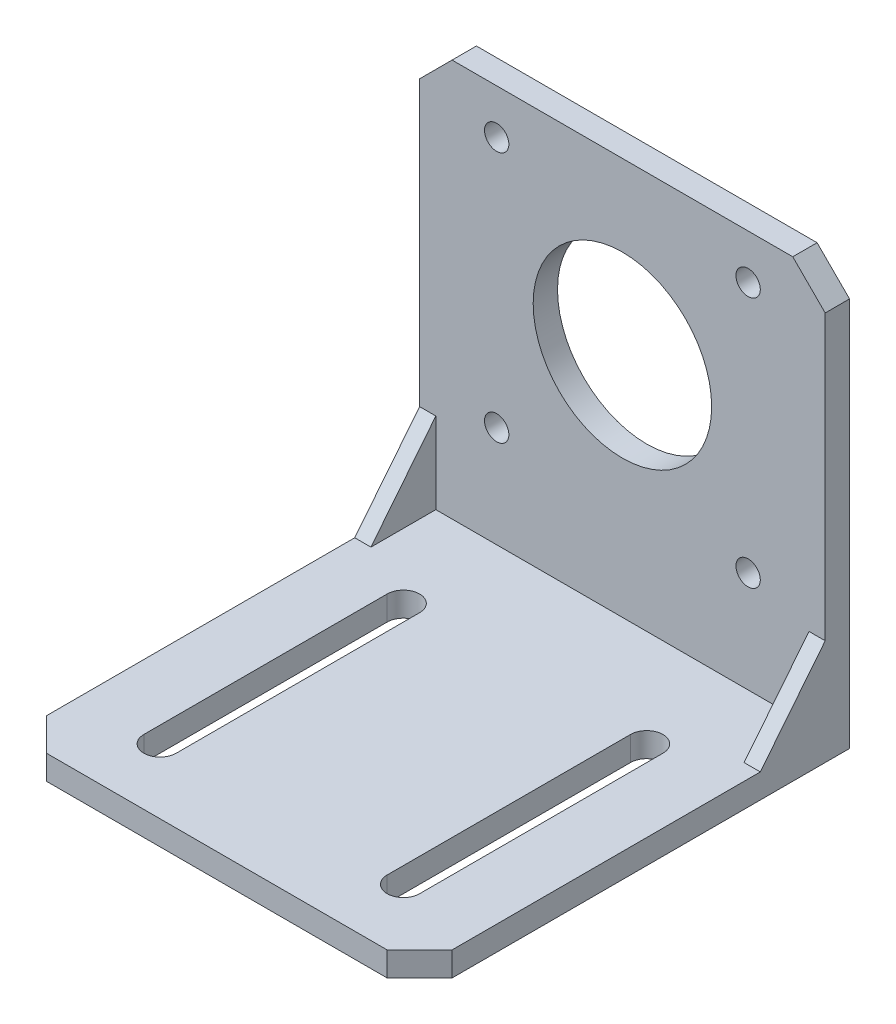
ISO-10303-21;
HEADER;
FILE_DESCRIPTION(('STEP AP214'),'2;1');
FILE_NAME('part.step','',(''),(''),'','','');
FILE_SCHEMA(('AUTOMOTIVE_DESIGN { 1 0 10303 214 1 1 1 1 }'));
ENDSEC;
DATA;
#1=APPLICATION_CONTEXT('core data for automotive mechanical design processes');
#2=APPLICATION_PROTOCOL_DEFINITION('international standard','automotive_design',2000,#1);
#3=PRODUCT_CONTEXT('',#1,'mechanical');
#4=PRODUCT('Part','Part','',(#3));
#5=PRODUCT_RELATED_PRODUCT_CATEGORY('part','',(#4));
#6=PRODUCT_DEFINITION_FORMATION('','',#4);
#7=PRODUCT_DEFINITION_CONTEXT('part definition',#1,'design');
#8=PRODUCT_DEFINITION('design','',#6,#7);
#9=PRODUCT_DEFINITION_SHAPE('','',#8);
#10=(LENGTH_UNIT() NAMED_UNIT(*) SI_UNIT(.MILLI.,.METRE.));
#11=(NAMED_UNIT(*) PLANE_ANGLE_UNIT() SI_UNIT($,.RADIAN.));
#12=(NAMED_UNIT(*) SI_UNIT($,.STERADIAN.) SOLID_ANGLE_UNIT());
#13=UNCERTAINTY_MEASURE_WITH_UNIT(LENGTH_MEASURE(1.E-05),#10,'distance_accuracy_value','');
#14=(GEOMETRIC_REPRESENTATION_CONTEXT(3) GLOBAL_UNCERTAINTY_ASSIGNED_CONTEXT((#13)) GLOBAL_UNIT_ASSIGNED_CONTEXT((#10,
#11,#12)) REPRESENTATION_CONTEXT('',''));
#15=CARTESIAN_POINT('',(0.,0.,0.));
#16=DIRECTION('',(0.,0.,1.));
#17=DIRECTION('',(1.,0.,0.));
#18=AXIS2_PLACEMENT_3D('',#15,#16,#17);
#19=CARTESIAN_POINT('',(0.,0.,3.));
#20=DIRECTION('',(0.,0.,1.));
#21=DIRECTION('',(1.,0.,0.));
#22=AXIS2_PLACEMENT_3D('',#19,#20,#21);
#23=PLANE('',#22);
#24=DIRECTION('',(-1.,0.,0.));
#25=VECTOR('',#24,1.);
#26=CARTESIAN_POINT('',(-23.,-13.,3.));
#27=LINE('',#26,#25);
#28=CARTESIAN_POINT('',(-23.,-13.,3.));
#29=VERTEX_POINT('',#28);
#30=CARTESIAN_POINT('',(-25.,-13.,3.));
#31=VERTEX_POINT('',#30);
#32=EDGE_CURVE('E268',#29,#31,#27,.T.);
#33=ORIENTED_EDGE('',*,*,#32,.F.);
#34=DIRECTION('',(0.,-1.,0.));
#35=VECTOR('',#34,1.);
#36=CARTESIAN_POINT('',(-23.,-13.,3.));
#37=LINE('',#36,#35);
#38=CARTESIAN_POINT('',(-23.,-23.,3.));
#39=VERTEX_POINT('',#38);
#40=EDGE_CURVE('E262',#29,#39,#37,.T.);
#41=ORIENTED_EDGE('',*,*,#40,.T.);
#42=DIRECTION('',(-1.,0.,0.));
#43=VECTOR('',#42,1.);
#44=CARTESIAN_POINT('',(-25.,-23.,3.));
#45=LINE('',#44,#43);
#46=CARTESIAN_POINT('',(23.,-23.,3.));
#47=VERTEX_POINT('',#46);
#48=EDGE_CURVE('E293',#47,#39,#45,.T.);
#49=ORIENTED_EDGE('',*,*,#48,.F.);
#50=DIRECTION('',(0.,-1.,0.));
#51=VECTOR('',#50,1.);
#52=CARTESIAN_POINT('',(23.,0.,3.));
#53=LINE('',#52,#51);
#54=CARTESIAN_POINT('',(23.,-13.,3.));
#55=VERTEX_POINT('',#54);
#56=EDGE_CURVE('E276',#55,#47,#53,.T.);
#57=ORIENTED_EDGE('',*,*,#56,.F.);
#58=DIRECTION('',(1.,0.,0.));
#59=VECTOR('',#58,1.);
#60=CARTESIAN_POINT('',(23.,-13.,3.));
#61=LINE('',#60,#59);
#62=CARTESIAN_POINT('',(25.,-13.,3.));
#63=VERTEX_POINT('',#62);
#64=EDGE_CURVE('E285',#55,#63,#61,.T.);
#65=ORIENTED_EDGE('',*,*,#64,.T.);
#66=DIRECTION('',(0.,1.,0.));
#67=VECTOR('',#66,1.);
#68=CARTESIAN_POINT('',(25.,26.,3.));
#69=LINE('',#68,#67);
#70=CARTESIAN_POINT('',(25.,22.,3.));
#71=VERTEX_POINT('',#70);
#72=EDGE_CURVE('E336',#63,#71,#69,.T.);
#73=ORIENTED_EDGE('',*,*,#72,.T.);
#74=DIRECTION('',(0.707106781186546,-0.707106781186549,0.));
#75=VECTOR('',#74,1.);
#76=CARTESIAN_POINT('',(23.5000000000001,23.4999999999999,3.));
#77=LINE('',#76,#75);
#78=CARTESIAN_POINT('',(21.,26.,3.));
#79=VERTEX_POINT('',#78);
#80=EDGE_CURVE('E371',#71,#79,#77,.F.);
#81=ORIENTED_EDGE('',*,*,#80,.T.);
#82=DIRECTION('',(-1.,0.,0.));
#83=VECTOR('',#82,1.);
#84=CARTESIAN_POINT('',(-25.,26.,3.));
#85=LINE('',#84,#83);
#86=CARTESIAN_POINT('',(-21.,26.,3.));
#87=VERTEX_POINT('',#86);
#88=EDGE_CURVE('E338',#79,#87,#85,.T.);
#89=ORIENTED_EDGE('',*,*,#88,.T.);
#90=DIRECTION('',(0.707106781186549,0.707106781186546,0.));
#91=VECTOR('',#90,1.);
#92=CARTESIAN_POINT('',(-23.5,23.5,3.));
#93=LINE('',#92,#91);
#94=CARTESIAN_POINT('',(-25.,22.,3.));
#95=VERTEX_POINT('',#94);
#96=EDGE_CURVE('E373',#87,#95,#93,.F.);
#97=ORIENTED_EDGE('',*,*,#96,.T.);
#98=DIRECTION('',(0.,-1.,0.));
#99=VECTOR('',#98,1.);
#100=CARTESIAN_POINT('',(-25.,26.,3.));
#101=LINE('',#100,#99);
#102=EDGE_CURVE('E342',#95,#31,#101,.T.);
#103=ORIENTED_EDGE('',*,*,#102,.T.);
#104=EDGE_LOOP('',(#33,#41,#49,#57,#65,#73,#81,#89,#97,#103));
#105=FACE_BOUND('',#104,.T.);
#106=CARTESIAN_POINT('',(15.5,-10.5,3.));
#107=DIRECTION('',(0.,0.,1.));
#108=DIRECTION('',(1.,0.,0.));
#109=AXIS2_PLACEMENT_3D('',#106,#107,#108);
#110=CIRCLE('',#109,1.5);
#111=CARTESIAN_POINT('',(17.,-10.5,3.));
#112=VERTEX_POINT('',#111);
#113=EDGE_CURVE('E312',#112,#112,#110,.T.);
#114=ORIENTED_EDGE('',*,*,#113,.F.);
#115=EDGE_LOOP('',(#114));
#116=FACE_BOUND('',#115,.T.);
#117=CARTESIAN_POINT('',(15.5,20.5,3.));
#118=DIRECTION('',(0.,0.,1.));
#119=DIRECTION('',(1.,0.,0.));
#120=AXIS2_PLACEMENT_3D('',#117,#118,#119);
#121=CIRCLE('',#120,1.5);
#122=CARTESIAN_POINT('',(17.,20.5,3.));
#123=VERTEX_POINT('',#122);
#124=EDGE_CURVE('E324',#123,#123,#121,.T.);
#125=ORIENTED_EDGE('',*,*,#124,.F.);
#126=EDGE_LOOP('',(#125));
#127=FACE_BOUND('',#126,.T.);
#128=CARTESIAN_POINT('',(0.,5.,3.));
#129=DIRECTION('',(0.,0.,1.));
#130=DIRECTION('',(1.,0.,0.));
#131=AXIS2_PLACEMENT_3D('',#128,#129,#130);
#132=CIRCLE('',#131,11.);
#133=CARTESIAN_POINT('',(11.,5.,3.));
#134=VERTEX_POINT('',#133);
#135=EDGE_CURVE('E330',#134,#134,#132,.T.);
#136=ORIENTED_EDGE('',*,*,#135,.F.);
#137=EDGE_LOOP('',(#136));
#138=FACE_BOUND('',#137,.T.);
#139=CARTESIAN_POINT('',(-15.5,20.5,3.));
#140=DIRECTION('',(0.,0.,1.));
#141=DIRECTION('',(1.,0.,0.));
#142=AXIS2_PLACEMENT_3D('',#139,#140,#141);
#143=CIRCLE('',#142,1.5);
#144=CARTESIAN_POINT('',(-14.,20.5,3.));
#145=VERTEX_POINT('',#144);
#146=EDGE_CURVE('E318',#145,#145,#143,.T.);
#147=ORIENTED_EDGE('',*,*,#146,.F.);
#148=EDGE_LOOP('',(#147));
#149=FACE_BOUND('',#148,.T.);
#150=CARTESIAN_POINT('',(-15.5,-10.5,3.));
#151=DIRECTION('',(0.,0.,1.));
#152=DIRECTION('',(1.,0.,0.));
#153=AXIS2_PLACEMENT_3D('',#150,#151,#152);
#154=CIRCLE('',#153,1.5);
#155=CARTESIAN_POINT('',(-14.,-10.5,3.));
#156=VERTEX_POINT('',#155);
#157=EDGE_CURVE('E306',#156,#156,#154,.T.);
#158=ORIENTED_EDGE('',*,*,#157,.F.);
#159=EDGE_LOOP('',(#158));
#160=FACE_BOUND('',#159,.T.);
#161=ADVANCED_FACE('F39',(#105,#116,#127,#138,#149,#160),#23,.T.);
#162=CARTESIAN_POINT('',(0.,0.,0.));
#163=DIRECTION('',(0.,0.,1.));
#164=DIRECTION('',(1.,0.,0.));
#165=AXIS2_PLACEMENT_3D('',#162,#163,#164);
#166=PLANE('',#165);
#167=DIRECTION('',(0.,-1.,0.));
#168=VECTOR('',#167,1.);
#169=CARTESIAN_POINT('',(-25.,26.,0.));
#170=LINE('',#169,#168);
#171=CARTESIAN_POINT('',(-25.,22.,0.));
#172=VERTEX_POINT('',#171);
#173=CARTESIAN_POINT('',(-25.,-26.,0.));
#174=VERTEX_POINT('',#173);
#175=EDGE_CURVE('E351',#172,#174,#170,.T.);
#176=ORIENTED_EDGE('',*,*,#175,.F.);
#177=DIRECTION('',(-0.707106781186549,-0.707106781186546,0.));
#178=VECTOR('',#177,1.);
#179=CARTESIAN_POINT('',(-25.,22.,0.));
#180=LINE('',#179,#178);
#181=CARTESIAN_POINT('',(-21.,26.,0.));
#182=VERTEX_POINT('',#181);
#183=EDGE_CURVE('E364',#172,#182,#180,.F.);
#184=ORIENTED_EDGE('',*,*,#183,.T.);
#185=DIRECTION('',(-1.,0.,0.));
#186=VECTOR('',#185,1.);
#187=CARTESIAN_POINT('',(-25.,26.,0.));
#188=LINE('',#187,#186);
#189=CARTESIAN_POINT('',(21.,26.,0.));
#190=VERTEX_POINT('',#189);
#191=EDGE_CURVE('E348',#190,#182,#188,.T.);
#192=ORIENTED_EDGE('',*,*,#191,.F.);
#193=DIRECTION('',(-0.707106781186546,0.707106781186549,0.));
#194=VECTOR('',#193,1.);
#195=CARTESIAN_POINT('',(21.,26.,0.));
#196=LINE('',#195,#194);
#197=CARTESIAN_POINT('',(25.,22.,0.));
#198=VERTEX_POINT('',#197);
#199=EDGE_CURVE('E362',#190,#198,#196,.F.);
#200=ORIENTED_EDGE('',*,*,#199,.T.);
#201=DIRECTION('',(0.,1.,0.));
#202=VECTOR('',#201,1.);
#203=CARTESIAN_POINT('',(25.,26.,0.));
#204=LINE('',#203,#202);
#205=CARTESIAN_POINT('',(25.,-26.,0.));
#206=VERTEX_POINT('',#205);
#207=EDGE_CURVE('E333',#206,#198,#204,.T.);
#208=ORIENTED_EDGE('',*,*,#207,.F.);
#209=DIRECTION('',(1.,0.,0.));
#210=VECTOR('',#209,1.);
#211=CARTESIAN_POINT('',(-25.,-26.,0.));
#212=LINE('',#211,#210);
#213=EDGE_CURVE('E339',#174,#206,#212,.T.);
#214=ORIENTED_EDGE('',*,*,#213,.F.);
#215=EDGE_LOOP('',(#176,#184,#192,#200,#208,#214));
#216=FACE_BOUND('',#215,.T.);
#217=CARTESIAN_POINT('',(0.,5.,0.));
#218=DIRECTION('',(0.,0.,1.));
#219=DIRECTION('',(1.,0.,0.));
#220=AXIS2_PLACEMENT_3D('',#217,#218,#219);
#221=CIRCLE('',#220,11.);
#222=CARTESIAN_POINT('',(11.,5.,0.));
#223=VERTEX_POINT('',#222);
#224=EDGE_CURVE('E327',#223,#223,#221,.T.);
#225=ORIENTED_EDGE('',*,*,#224,.T.);
#226=EDGE_LOOP('',(#225));
#227=FACE_BOUND('',#226,.T.);
#228=CARTESIAN_POINT('',(15.5,20.5,0.));
#229=DIRECTION('',(0.,0.,1.));
#230=DIRECTION('',(1.,0.,0.));
#231=AXIS2_PLACEMENT_3D('',#228,#229,#230);
#232=CIRCLE('',#231,1.5);
#233=CARTESIAN_POINT('',(17.,20.5,0.));
#234=VERTEX_POINT('',#233);
#235=EDGE_CURVE('E321',#234,#234,#232,.T.);
#236=ORIENTED_EDGE('',*,*,#235,.T.);
#237=EDGE_LOOP('',(#236));
#238=FACE_BOUND('',#237,.T.);
#239=CARTESIAN_POINT('',(-15.5,20.5,0.));
#240=DIRECTION('',(0.,0.,1.));
#241=DIRECTION('',(1.,0.,0.));
#242=AXIS2_PLACEMENT_3D('',#239,#240,#241);
#243=CIRCLE('',#242,1.5);
#244=CARTESIAN_POINT('',(-14.,20.5,0.));
#245=VERTEX_POINT('',#244);
#246=EDGE_CURVE('E315',#245,#245,#243,.T.);
#247=ORIENTED_EDGE('',*,*,#246,.T.);
#248=EDGE_LOOP('',(#247));
#249=FACE_BOUND('',#248,.T.);
#250=CARTESIAN_POINT('',(15.5,-10.5,0.));
#251=DIRECTION('',(0.,0.,1.));
#252=DIRECTION('',(1.,0.,0.));
#253=AXIS2_PLACEMENT_3D('',#250,#251,#252);
#254=CIRCLE('',#253,1.5);
#255=CARTESIAN_POINT('',(17.,-10.5,0.));
#256=VERTEX_POINT('',#255);
#257=EDGE_CURVE('E309',#256,#256,#254,.T.);
#258=ORIENTED_EDGE('',*,*,#257,.T.);
#259=EDGE_LOOP('',(#258));
#260=FACE_BOUND('',#259,.T.);
#261=CARTESIAN_POINT('',(-15.5,-10.5,0.));
#262=DIRECTION('',(0.,0.,1.));
#263=DIRECTION('',(1.,0.,0.));
#264=AXIS2_PLACEMENT_3D('',#261,#262,#263);
#265=CIRCLE('',#264,1.5);
#266=CARTESIAN_POINT('',(-14.,-10.5,0.));
#267=VERTEX_POINT('',#266);
#268=EDGE_CURVE('E301',#267,#267,#265,.T.);
#269=ORIENTED_EDGE('',*,*,#268,.T.);
#270=EDGE_LOOP('',(#269));
#271=FACE_BOUND('',#270,.T.);
#272=ADVANCED_FACE('F439',(#216,#227,#238,#249,#260,#271),#166,.F.);
#273=CARTESIAN_POINT('',(25.,26.,3.));
#274=DIRECTION('',(-1.,0.,0.));
#275=DIRECTION('',(0.,-1.,0.));
#276=AXIS2_PLACEMENT_3D('',#273,#274,#275);
#277=PLANE('',#276);
#278=DIRECTION('',(0.,0.,-1.));
#279=VECTOR('',#278,1.);
#280=CARTESIAN_POINT('',(25.,-23.,156.089919145473));
#281=LINE('',#280,#279);
#282=CARTESIAN_POINT('',(25.,-23.,49.));
#283=VERTEX_POINT('',#282);
#284=CARTESIAN_POINT('',(25.,-23.,11.));
#285=VERTEX_POINT('',#284);
#286=EDGE_CURVE('E297',#283,#285,#281,.T.);
#287=ORIENTED_EDGE('',*,*,#286,.F.);
#288=DIRECTION('',(0.,-1.,0.));
#289=VECTOR('',#288,1.);
#290=CARTESIAN_POINT('',(25.,-26.,49.));
#291=LINE('',#290,#289);
#292=CARTESIAN_POINT('',(25.,-26.,49.));
#293=VERTEX_POINT('',#292);
#294=EDGE_CURVE('E388',#283,#293,#291,.T.);
#295=ORIENTED_EDGE('',*,*,#294,.T.);
#296=DIRECTION('',(0.,0.,-1.));
#297=VECTOR('',#296,1.);
#298=CARTESIAN_POINT('',(25.,-26.,3.));
#299=LINE('',#298,#297);
#300=EDGE_CURVE('E345',#293,#206,#299,.T.);
#301=ORIENTED_EDGE('',*,*,#300,.T.);
#302=ORIENTED_EDGE('',*,*,#207,.T.);
#303=DIRECTION('',(0.,0.,1.));
#304=VECTOR('',#303,1.);
#305=CARTESIAN_POINT('',(25.,22.,3.));
#306=LINE('',#305,#304);
#307=EDGE_CURVE('E375',#198,#71,#306,.T.);
#308=ORIENTED_EDGE('',*,*,#307,.T.);
#309=ORIENTED_EDGE('',*,*,#72,.F.);
#310=DIRECTION('',(0.,-0.78086880944303,0.624695047554425));
#311=VECTOR('',#310,1.);
#312=CARTESIAN_POINT('',(25.,-3.60975609756097,-4.51219512195122));
#313=LINE('',#312,#311);
#314=EDGE_CURVE('E274',#63,#285,#313,.T.);
#315=ORIENTED_EDGE('',*,*,#314,.T.);
#316=EDGE_LOOP('',(#287,#295,#301,#302,#308,#309,#315));
#317=FACE_BOUND('',#316,.T.);
#318=ADVANCED_FACE('F407',(#317),#277,.F.);
#319=CARTESIAN_POINT('',(-25.,26.,3.));
#320=DIRECTION('',(0.,-1.,0.));
#321=DIRECTION('',(0.,0.,-1.));
#322=AXIS2_PLACEMENT_3D('',#319,#320,#321);
#323=PLANE('',#322);
#324=ORIENTED_EDGE('',*,*,#191,.T.);
#325=DIRECTION('',(0.,0.,1.));
#326=VECTOR('',#325,1.);
#327=CARTESIAN_POINT('',(-21.,26.,3.));
#328=LINE('',#327,#326);
#329=EDGE_CURVE('E369',#182,#87,#328,.T.);
#330=ORIENTED_EDGE('',*,*,#329,.T.);
#331=ORIENTED_EDGE('',*,*,#88,.F.);
#332=DIRECTION('',(0.,0.,-1.));
#333=VECTOR('',#332,1.);
#334=CARTESIAN_POINT('',(21.,26.,3.));
#335=LINE('',#334,#333);
#336=EDGE_CURVE('E366',#79,#190,#335,.T.);
#337=ORIENTED_EDGE('',*,*,#336,.T.);
#338=EDGE_LOOP('',(#324,#330,#331,#337));
#339=FACE_BOUND('',#338,.T.);
#340=ADVANCED_FACE('F443',(#339),#323,.F.);
#341=CARTESIAN_POINT('',(-25.,26.,3.));
#342=DIRECTION('',(1.,0.,0.));
#343=DIRECTION('',(0.,1.,0.));
#344=AXIS2_PLACEMENT_3D('',#341,#342,#343);
#345=PLANE('',#344);
#346=DIRECTION('',(0.,0.,-1.));
#347=VECTOR('',#346,1.);
#348=CARTESIAN_POINT('',(-25.,-26.,3.));
#349=LINE('',#348,#347);
#350=CARTESIAN_POINT('',(-25.,-26.,49.));
#351=VERTEX_POINT('',#350);
#352=EDGE_CURVE('E357',#351,#174,#349,.T.);
#353=ORIENTED_EDGE('',*,*,#352,.F.);
#354=DIRECTION('',(0.,1.,0.));
#355=VECTOR('',#354,1.);
#356=CARTESIAN_POINT('',(-25.,-23.,49.));
#357=LINE('',#356,#355);
#358=CARTESIAN_POINT('',(-25.,-23.,49.));
#359=VERTEX_POINT('',#358);
#360=EDGE_CURVE('E12',#351,#359,#357,.T.);
#361=ORIENTED_EDGE('',*,*,#360,.T.);
#362=DIRECTION('',(0.,0.,-1.));
#363=VECTOR('',#362,1.);
#364=CARTESIAN_POINT('',(-25.,-23.,156.089919145473));
#365=LINE('',#364,#363);
#366=CARTESIAN_POINT('',(-25.,-23.,11.));
#367=VERTEX_POINT('',#366);
#368=EDGE_CURVE('E291',#359,#367,#365,.T.);
#369=ORIENTED_EDGE('',*,*,#368,.T.);
#370=DIRECTION('',(0.,0.78086880944303,-0.624695047554424));
#371=VECTOR('',#370,1.);
#372=CARTESIAN_POINT('',(-25.,-23.,11.));
#373=LINE('',#372,#371);
#374=EDGE_CURVE('E226',#367,#31,#373,.T.);
#375=ORIENTED_EDGE('',*,*,#374,.T.);
#376=ORIENTED_EDGE('',*,*,#102,.F.);
#377=DIRECTION('',(0.,0.,-1.));
#378=VECTOR('',#377,1.);
#379=CARTESIAN_POINT('',(-25.,22.,3.));
#380=LINE('',#379,#378);
#381=EDGE_CURVE('E359',#95,#172,#380,.T.);
#382=ORIENTED_EDGE('',*,*,#381,.T.);
#383=ORIENTED_EDGE('',*,*,#175,.T.);
#384=EDGE_LOOP('',(#353,#361,#369,#375,#376,#382,#383));
#385=FACE_BOUND('',#384,.T.);
#386=ADVANCED_FACE('F432',(#385),#345,.F.);
#387=CARTESIAN_POINT('',(-25.,-26.,3.));
#388=DIRECTION('',(0.,1.,0.));
#389=DIRECTION('',(0.,0.,1.));
#390=AXIS2_PLACEMENT_3D('',#387,#388,#389);
#391=PLANE('',#390);
#392=DIRECTION('',(0.,0.,-1.));
#393=VECTOR('',#392,1.);
#394=CARTESIAN_POINT('',(-13.,-26.,15.));
#395=LINE('',#394,#393);
#396=CARTESIAN_POINT('',(-13.,-26.,45.));
#397=VERTEX_POINT('',#396);
#398=CARTESIAN_POINT('',(-13.,-26.,15.));
#399=VERTEX_POINT('',#398);
#400=EDGE_CURVE('E200',#397,#399,#395,.T.);
#401=ORIENTED_EDGE('',*,*,#400,.T.);
#402=CARTESIAN_POINT('',(-15.,-26.,15.));
#403=DIRECTION('',(0.,1.,0.));
#404=DIRECTION('',(0.,0.,1.));
#405=AXIS2_PLACEMENT_3D('',#402,#403,#404);
#406=CIRCLE('',#405,2.);
#407=CARTESIAN_POINT('',(-17.,-26.,15.));
#408=VERTEX_POINT('',#407);
#409=EDGE_CURVE('E192',#399,#408,#406,.T.);
#410=ORIENTED_EDGE('',*,*,#409,.T.);
#411=DIRECTION('',(0.,0.,1.));
#412=VECTOR('',#411,1.);
#413=CARTESIAN_POINT('',(-17.,-26.,15.));
#414=LINE('',#413,#412);
#415=CARTESIAN_POINT('',(-17.,-26.,45.));
#416=VERTEX_POINT('',#415);
#417=EDGE_CURVE('E203',#408,#416,#414,.T.);
#418=ORIENTED_EDGE('',*,*,#417,.T.);
#419=CARTESIAN_POINT('',(-15.,-26.,45.));
#420=DIRECTION('',(0.,1.,0.));
#421=DIRECTION('',(0.,0.,1.));
#422=AXIS2_PLACEMENT_3D('',#419,#420,#421);
#423=CIRCLE('',#422,2.);
#424=EDGE_CURVE('E55',#416,#397,#423,.T.);
#425=ORIENTED_EDGE('',*,*,#424,.T.);
#426=EDGE_LOOP('',(#401,#410,#418,#425));
#427=FACE_BOUND('',#426,.T.);
#428=DIRECTION('',(0.,0.,-1.));
#429=VECTOR('',#428,1.);
#430=CARTESIAN_POINT('',(17.,-26.,15.));
#431=LINE('',#430,#429);
#432=CARTESIAN_POINT('',(17.,-26.,45.));
#433=VERTEX_POINT('',#432);
#434=CARTESIAN_POINT('',(17.,-26.,15.));
#435=VERTEX_POINT('',#434);
#436=EDGE_CURVE('E238',#433,#435,#431,.T.);
#437=ORIENTED_EDGE('',*,*,#436,.T.);
#438=CARTESIAN_POINT('',(15.,-26.,15.));
#439=DIRECTION('',(0.,1.,0.));
#440=DIRECTION('',(0.,0.,-1.));
#441=AXIS2_PLACEMENT_3D('',#438,#439,#440);
#442=CIRCLE('',#441,2.);
#443=CARTESIAN_POINT('',(13.,-26.,15.));
#444=VERTEX_POINT('',#443);
#445=EDGE_CURVE('E230',#435,#444,#442,.T.);
#446=ORIENTED_EDGE('',*,*,#445,.T.);
#447=DIRECTION('',(0.,0.,1.));
#448=VECTOR('',#447,1.);
#449=CARTESIAN_POINT('',(13.,-26.,15.));
#450=LINE('',#449,#448);
#451=CARTESIAN_POINT('',(13.,-26.,45.));
#452=VERTEX_POINT('',#451);
#453=EDGE_CURVE('E233',#444,#452,#450,.T.);
#454=ORIENTED_EDGE('',*,*,#453,.T.);
#455=CARTESIAN_POINT('',(15.,-26.,45.));
#456=DIRECTION('',(0.,1.,0.));
#457=DIRECTION('',(0.,0.,-1.));
#458=AXIS2_PLACEMENT_3D('',#455,#456,#457);
#459=CIRCLE('',#458,1.99999999999999);
#460=EDGE_CURVE('E63',#452,#433,#459,.T.);
#461=ORIENTED_EDGE('',*,*,#460,.T.);
#462=EDGE_LOOP('',(#437,#446,#454,#461));
#463=FACE_BOUND('',#462,.T.);
#464=ORIENTED_EDGE('',*,*,#300,.F.);
#465=DIRECTION('',(-0.707106781186546,0.,0.707106781186549));
#466=VECTOR('',#465,1.);
#467=CARTESIAN_POINT('',(21.,-26.,53.));
#468=LINE('',#467,#466);
#469=CARTESIAN_POINT('',(21.,-26.,53.));
#470=VERTEX_POINT('',#469);
#471=EDGE_CURVE('E48',#293,#470,#468,.T.);
#472=ORIENTED_EDGE('',*,*,#471,.T.);
#473=DIRECTION('',(1.,0.,0.));
#474=VECTOR('',#473,1.);
#475=CARTESIAN_POINT('',(-25.,-26.,53.));
#476=LINE('',#475,#474);
#477=CARTESIAN_POINT('',(-21.,-26.,53.));
#478=VERTEX_POINT('',#477);
#479=EDGE_CURVE('E298',#478,#470,#476,.T.);
#480=ORIENTED_EDGE('',*,*,#479,.F.);
#481=DIRECTION('',(-0.707106781186546,0.,-0.707106781186549));
#482=VECTOR('',#481,1.);
#483=CARTESIAN_POINT('',(-21.,-26.,53.));
#484=LINE('',#483,#482);
#485=EDGE_CURVE('E390',#478,#351,#484,.T.);
#486=ORIENTED_EDGE('',*,*,#485,.T.);
#487=ORIENTED_EDGE('',*,*,#352,.T.);
#488=ORIENTED_EDGE('',*,*,#213,.T.);
#489=EDGE_LOOP('',(#464,#472,#480,#486,#487,#488));
#490=FACE_BOUND('',#489,.T.);
#491=ADVANCED_FACE('F207',(#427,#463,#490),#391,.F.);
#492=CARTESIAN_POINT('',(0.,5.,3.));
#493=DIRECTION('',(0.,0.,-1.));
#494=DIRECTION('',(-1.,0.,0.));
#495=AXIS2_PLACEMENT_3D('',#492,#493,#494);
#496=CYLINDRICAL_SURFACE('',#495,11.);
#497=ORIENTED_EDGE('',*,*,#135,.T.);
#498=EDGE_LOOP('',(#497));
#499=FACE_BOUND('',#498,.T.);
#500=ORIENTED_EDGE('',*,*,#224,.F.);
#501=EDGE_LOOP('',(#500));
#502=FACE_BOUND('',#501,.T.);
#503=ADVANCED_FACE('F470',(#499,#502),#496,.F.);
#504=CARTESIAN_POINT('',(15.5,20.5,3.));
#505=DIRECTION('',(0.,0.,-1.));
#506=DIRECTION('',(-1.,0.,0.));
#507=AXIS2_PLACEMENT_3D('',#504,#505,#506);
#508=CYLINDRICAL_SURFACE('',#507,1.5);
#509=ORIENTED_EDGE('',*,*,#124,.T.);
#510=EDGE_LOOP('',(#509));
#511=FACE_BOUND('',#510,.T.);
#512=ORIENTED_EDGE('',*,*,#235,.F.);
#513=EDGE_LOOP('',(#512));
#514=FACE_BOUND('',#513,.T.);
#515=ADVANCED_FACE('F518',(#511,#514),#508,.F.);
#516=CARTESIAN_POINT('',(-15.5,20.5,3.));
#517=DIRECTION('',(0.,0.,-1.));
#518=DIRECTION('',(-1.,0.,0.));
#519=AXIS2_PLACEMENT_3D('',#516,#517,#518);
#520=CYLINDRICAL_SURFACE('',#519,1.5);
#521=ORIENTED_EDGE('',*,*,#146,.T.);
#522=EDGE_LOOP('',(#521));
#523=FACE_BOUND('',#522,.T.);
#524=ORIENTED_EDGE('',*,*,#246,.F.);
#525=EDGE_LOOP('',(#524));
#526=FACE_BOUND('',#525,.T.);
#527=ADVANCED_FACE('F515',(#523,#526),#520,.F.);
#528=CARTESIAN_POINT('',(15.5,-10.5,3.));
#529=DIRECTION('',(0.,0.,-1.));
#530=DIRECTION('',(-1.,0.,0.));
#531=AXIS2_PLACEMENT_3D('',#528,#529,#530);
#532=CYLINDRICAL_SURFACE('',#531,1.5);
#533=ORIENTED_EDGE('',*,*,#113,.T.);
#534=EDGE_LOOP('',(#533));
#535=FACE_BOUND('',#534,.T.);
#536=ORIENTED_EDGE('',*,*,#257,.F.);
#537=EDGE_LOOP('',(#536));
#538=FACE_BOUND('',#537,.T.);
#539=ADVANCED_FACE('F511',(#535,#538),#532,.F.);
#540=CARTESIAN_POINT('',(-15.5,-10.5,3.));
#541=DIRECTION('',(0.,0.,-1.));
#542=DIRECTION('',(-1.,0.,0.));
#543=AXIS2_PLACEMENT_3D('',#540,#541,#542);
#544=CYLINDRICAL_SURFACE('',#543,1.5);
#545=ORIENTED_EDGE('',*,*,#157,.T.);
#546=EDGE_LOOP('',(#545));
#547=FACE_BOUND('',#546,.T.);
#548=ORIENTED_EDGE('',*,*,#268,.F.);
#549=EDGE_LOOP('',(#548));
#550=FACE_BOUND('',#549,.T.);
#551=ADVANCED_FACE('F487',(#547,#550),#544,.F.);
#552=CARTESIAN_POINT('',(-25.,22.,3.));
#553=DIRECTION('',(0.707106781186546,-0.707106781186549,0.));
#554=DIRECTION('',(0.,0.,-1.));
#555=AXIS2_PLACEMENT_3D('',#552,#553,#554);
#556=PLANE('',#555);
#557=ORIENTED_EDGE('',*,*,#96,.F.);
#558=ORIENTED_EDGE('',*,*,#329,.F.);
#559=ORIENTED_EDGE('',*,*,#183,.F.);
#560=ORIENTED_EDGE('',*,*,#381,.F.);
#561=EDGE_LOOP('',(#557,#558,#559,#560));
#562=FACE_BOUND('',#561,.T.);
#563=ADVANCED_FACE('F435',(#562),#556,.F.);
#564=CARTESIAN_POINT('',(21.,26.,3.));
#565=DIRECTION('',(-0.707106781186549,-0.707106781186546,0.));
#566=DIRECTION('',(0.,0.,-1.));
#567=AXIS2_PLACEMENT_3D('',#564,#565,#566);
#568=PLANE('',#567);
#569=ORIENTED_EDGE('',*,*,#80,.F.);
#570=ORIENTED_EDGE('',*,*,#307,.F.);
#571=ORIENTED_EDGE('',*,*,#199,.F.);
#572=ORIENTED_EDGE('',*,*,#336,.F.);
#573=EDGE_LOOP('',(#569,#570,#571,#572));
#574=FACE_BOUND('',#573,.T.);
#575=ADVANCED_FACE('F448',(#574),#568,.F.);
#576=CARTESIAN_POINT('',(-25.,-23.,156.089919145473));
#577=DIRECTION('',(0.,-1.,0.));
#578=DIRECTION('',(0.,0.,-1.));
#579=AXIS2_PLACEMENT_3D('',#576,#577,#578);
#580=PLANE('',#579);
#581=DIRECTION('',(0.,0.,1.));
#582=VECTOR('',#581,1.);
#583=CARTESIAN_POINT('',(-17.,-23.,15.));
#584=LINE('',#583,#582);
#585=CARTESIAN_POINT('',(-17.,-23.,15.));
#586=VERTEX_POINT('',#585);
#587=CARTESIAN_POINT('',(-17.,-23.,45.));
#588=VERTEX_POINT('',#587);
#589=EDGE_CURVE('E219',#586,#588,#584,.T.);
#590=ORIENTED_EDGE('',*,*,#589,.F.);
#591=CARTESIAN_POINT('',(-15.,-23.,15.));
#592=DIRECTION('',(0.,1.,0.));
#593=DIRECTION('',(0.,0.,1.));
#594=AXIS2_PLACEMENT_3D('',#591,#592,#593);
#595=CIRCLE('',#594,2.);
#596=CARTESIAN_POINT('',(-13.,-23.,15.));
#597=VERTEX_POINT('',#596);
#598=EDGE_CURVE('E195',#597,#586,#595,.T.);
#599=ORIENTED_EDGE('',*,*,#598,.F.);
#600=DIRECTION('',(0.,0.,-1.));
#601=VECTOR('',#600,1.);
#602=CARTESIAN_POINT('',(-13.,-23.,15.));
#603=LINE('',#602,#601);
#604=CARTESIAN_POINT('',(-13.,-23.,45.));
#605=VERTEX_POINT('',#604);
#606=EDGE_CURVE('E210',#605,#597,#603,.T.);
#607=ORIENTED_EDGE('',*,*,#606,.F.);
#608=CARTESIAN_POINT('',(-15.,-23.,45.));
#609=DIRECTION('',(0.,1.,0.));
#610=DIRECTION('',(0.,0.,1.));
#611=AXIS2_PLACEMENT_3D('',#608,#609,#610);
#612=CIRCLE('',#611,2.);
#613=EDGE_CURVE('E213',#588,#605,#612,.T.);
#614=ORIENTED_EDGE('',*,*,#613,.F.);
#615=EDGE_LOOP('',(#590,#599,#607,#614));
#616=FACE_BOUND('',#615,.T.);
#617=DIRECTION('',(0.,0.,1.));
#618=VECTOR('',#617,1.);
#619=CARTESIAN_POINT('',(13.,-23.,15.));
#620=LINE('',#619,#618);
#621=CARTESIAN_POINT('',(13.,-23.,15.));
#622=VERTEX_POINT('',#621);
#623=CARTESIAN_POINT('',(13.,-23.,45.));
#624=VERTEX_POINT('',#623);
#625=EDGE_CURVE('E244',#622,#624,#620,.T.);
#626=ORIENTED_EDGE('',*,*,#625,.F.);
#627=CARTESIAN_POINT('',(15.,-23.,15.));
#628=DIRECTION('',(0.,1.,0.));
#629=DIRECTION('',(0.,0.,-1.));
#630=AXIS2_PLACEMENT_3D('',#627,#628,#629);
#631=CIRCLE('',#630,2.);
#632=CARTESIAN_POINT('',(17.,-23.,15.));
#633=VERTEX_POINT('',#632);
#634=EDGE_CURVE('E242',#633,#622,#631,.T.);
#635=ORIENTED_EDGE('',*,*,#634,.F.);
#636=DIRECTION('',(0.,0.,-1.));
#637=VECTOR('',#636,1.);
#638=CARTESIAN_POINT('',(17.,-23.,15.));
#639=LINE('',#638,#637);
#640=CARTESIAN_POINT('',(17.,-23.,45.));
#641=VERTEX_POINT('',#640);
#642=EDGE_CURVE('E234',#641,#633,#639,.T.);
#643=ORIENTED_EDGE('',*,*,#642,.F.);
#644=CARTESIAN_POINT('',(15.,-23.,45.));
#645=DIRECTION('',(0.,1.,0.));
#646=DIRECTION('',(0.,0.,-1.));
#647=AXIS2_PLACEMENT_3D('',#644,#645,#646);
#648=CIRCLE('',#647,1.99999999999999);
#649=EDGE_CURVE('E247',#624,#641,#648,.T.);
#650=ORIENTED_EDGE('',*,*,#649,.F.);
#651=EDGE_LOOP('',(#626,#635,#643,#650));
#652=FACE_BOUND('',#651,.T.);
#653=DIRECTION('',(-1.,0.,0.));
#654=VECTOR('',#653,1.);
#655=CARTESIAN_POINT('',(-25.,-23.,53.));
#656=LINE('',#655,#654);
#657=CARTESIAN_POINT('',(21.,-23.,53.));
#658=VERTEX_POINT('',#657);
#659=CARTESIAN_POINT('',(-21.,-23.,53.));
#660=VERTEX_POINT('',#659);
#661=EDGE_CURVE('E296',#658,#660,#656,.T.);
#662=ORIENTED_EDGE('',*,*,#661,.F.);
#663=DIRECTION('',(0.707106781186546,0.,-0.707106781186549));
#664=VECTOR('',#663,1.);
#665=CARTESIAN_POINT('',(21.,-23.,53.));
#666=LINE('',#665,#664);
#667=EDGE_CURVE('E386',#658,#283,#666,.T.);
#668=ORIENTED_EDGE('',*,*,#667,.T.);
#669=ORIENTED_EDGE('',*,*,#286,.T.);
#670=DIRECTION('',(1.,0.,0.));
#671=VECTOR('',#670,1.);
#672=CARTESIAN_POINT('',(23.,-23.,11.));
#673=LINE('',#672,#671);
#674=CARTESIAN_POINT('',(23.,-23.,11.));
#675=VERTEX_POINT('',#674);
#676=EDGE_CURVE('E288',#675,#285,#673,.T.);
#677=ORIENTED_EDGE('',*,*,#676,.F.);
#678=DIRECTION('',(0.,0.,1.));
#679=VECTOR('',#678,1.);
#680=CARTESIAN_POINT('',(23.,-23.,0.));
#681=LINE('',#680,#679);
#682=EDGE_CURVE('E282',#47,#675,#681,.T.);
#683=ORIENTED_EDGE('',*,*,#682,.F.);
#684=ORIENTED_EDGE('',*,*,#48,.T.);
#685=DIRECTION('',(0.,0.,1.));
#686=VECTOR('',#685,1.);
#687=CARTESIAN_POINT('',(-23.,-23.,3.));
#688=LINE('',#687,#686);
#689=CARTESIAN_POINT('',(-23.,-23.,11.));
#690=VERTEX_POINT('',#689);
#691=EDGE_CURVE('E265',#39,#690,#688,.T.);
#692=ORIENTED_EDGE('',*,*,#691,.T.);
#693=DIRECTION('',(-1.,0.,0.));
#694=VECTOR('',#693,1.);
#695=CARTESIAN_POINT('',(-23.,-23.,11.));
#696=LINE('',#695,#694);
#697=EDGE_CURVE('E271',#690,#367,#696,.T.);
#698=ORIENTED_EDGE('',*,*,#697,.T.);
#699=ORIENTED_EDGE('',*,*,#368,.F.);
#700=DIRECTION('',(0.707106781186546,0.,0.707106781186549));
#701=VECTOR('',#700,1.);
#702=CARTESIAN_POINT('',(-21.,-23.,53.));
#703=LINE('',#702,#701);
#704=EDGE_CURVE('E384',#359,#660,#703,.T.);
#705=ORIENTED_EDGE('',*,*,#704,.T.);
#706=EDGE_LOOP('',(#662,#668,#669,#677,#683,#684,#692,#698,#699,#705));
#707=FACE_BOUND('',#706,.T.);
#708=ADVANCED_FACE('F405',(#616,#652,#707),#580,.F.);
#709=CARTESIAN_POINT('',(0.,0.,53.));
#710=DIRECTION('',(0.,0.,1.));
#711=DIRECTION('',(1.,0.,0.));
#712=AXIS2_PLACEMENT_3D('',#709,#710,#711);
#713=PLANE('',#712);
#714=ORIENTED_EDGE('',*,*,#479,.T.);
#715=DIRECTION('',(0.,1.,0.));
#716=VECTOR('',#715,1.);
#717=CARTESIAN_POINT('',(21.,-23.,53.));
#718=LINE('',#717,#716);
#719=EDGE_CURVE('E381',#470,#658,#718,.T.);
#720=ORIENTED_EDGE('',*,*,#719,.T.);
#721=ORIENTED_EDGE('',*,*,#661,.T.);
#722=DIRECTION('',(0.,-1.,0.));
#723=VECTOR('',#722,1.);
#724=CARTESIAN_POINT('',(-21.,-26.,53.));
#725=LINE('',#724,#723);
#726=EDGE_CURVE('E378',#660,#478,#725,.T.);
#727=ORIENTED_EDGE('',*,*,#726,.T.);
#728=EDGE_LOOP('',(#714,#720,#721,#727));
#729=FACE_BOUND('',#728,.T.);
#730=ADVANCED_FACE('F399',(#729),#713,.T.);
#731=CARTESIAN_POINT('',(23.,-3.60975609756097,-4.51219512195122));
#732=DIRECTION('',(0.,0.624695047554425,0.78086880944303));
#733=DIRECTION('',(0.,-0.78086880944303,0.624695047554425));
#734=AXIS2_PLACEMENT_3D('',#731,#732,#733);
#735=PLANE('',#734);
#736=ORIENTED_EDGE('',*,*,#314,.F.);
#737=ORIENTED_EDGE('',*,*,#64,.F.);
#738=DIRECTION('',(0.,-0.78086880944303,0.624695047554425));
#739=VECTOR('',#738,1.);
#740=CARTESIAN_POINT('',(23.,-3.60975609756097,-4.51219512195122));
#741=LINE('',#740,#739);
#742=EDGE_CURVE('E279',#55,#675,#741,.T.);
#743=ORIENTED_EDGE('',*,*,#742,.T.);
#744=ORIENTED_EDGE('',*,*,#676,.T.);
#745=EDGE_LOOP('',(#736,#737,#743,#744));
#746=FACE_BOUND('',#745,.T.);
#747=ADVANCED_FACE('F412',(#746),#735,.T.);
#748=CARTESIAN_POINT('',(23.,0.,0.));
#749=DIRECTION('',(1.,0.,0.));
#750=DIRECTION('',(0.,1.,0.));
#751=AXIS2_PLACEMENT_3D('',#748,#749,#750);
#752=PLANE('',#751);
#753=ORIENTED_EDGE('',*,*,#56,.T.);
#754=ORIENTED_EDGE('',*,*,#682,.T.);
#755=ORIENTED_EDGE('',*,*,#742,.F.);
#756=EDGE_LOOP('',(#753,#754,#755));
#757=FACE_BOUND('',#756,.T.);
#758=ADVANCED_FACE('F416',(#757),#752,.F.);
#759=CARTESIAN_POINT('',(-23.,-23.,11.));
#760=DIRECTION('',(0.,0.624695047554425,0.78086880944303));
#761=DIRECTION('',(0.,-0.78086880944303,0.624695047554425));
#762=AXIS2_PLACEMENT_3D('',#759,#760,#761);
#763=PLANE('',#762);
#764=ORIENTED_EDGE('',*,*,#374,.F.);
#765=ORIENTED_EDGE('',*,*,#697,.F.);
#766=DIRECTION('',(0.,0.78086880944303,-0.624695047554424));
#767=VECTOR('',#766,1.);
#768=CARTESIAN_POINT('',(-23.,-23.,11.));
#769=LINE('',#768,#767);
#770=EDGE_CURVE('E259',#690,#29,#769,.T.);
#771=ORIENTED_EDGE('',*,*,#770,.T.);
#772=ORIENTED_EDGE('',*,*,#32,.T.);
#773=EDGE_LOOP('',(#764,#765,#771,#772));
#774=FACE_BOUND('',#773,.T.);
#775=ADVANCED_FACE('F426',(#774),#763,.T.);
#776=CARTESIAN_POINT('',(-23.,0.,0.));
#777=DIRECTION('',(1.,0.,0.));
#778=DIRECTION('',(0.,1.,0.));
#779=AXIS2_PLACEMENT_3D('',#776,#777,#778);
#780=PLANE('',#779);
#781=ORIENTED_EDGE('',*,*,#770,.F.);
#782=ORIENTED_EDGE('',*,*,#691,.F.);
#783=ORIENTED_EDGE('',*,*,#40,.F.);
#784=EDGE_LOOP('',(#781,#782,#783));
#785=FACE_BOUND('',#784,.T.);
#786=ADVANCED_FACE('F423',(#785),#780,.T.);
#787=CARTESIAN_POINT('',(21.,0.,53.));
#788=DIRECTION('',(0.707106781186549,0.,0.707106781186546));
#789=DIRECTION('',(0.,-1.,0.));
#790=AXIS2_PLACEMENT_3D('',#787,#788,#789);
#791=PLANE('',#790);
#792=ORIENTED_EDGE('',*,*,#471,.F.);
#793=ORIENTED_EDGE('',*,*,#294,.F.);
#794=ORIENTED_EDGE('',*,*,#667,.F.);
#795=ORIENTED_EDGE('',*,*,#719,.F.);
#796=EDGE_LOOP('',(#792,#793,#794,#795));
#797=FACE_BOUND('',#796,.T.);
#798=ADVANCED_FACE('F402',(#797),#791,.T.);
#799=CARTESIAN_POINT('',(-21.,0.,53.));
#800=DIRECTION('',(-0.707106781186549,0.,0.707106781186546));
#801=DIRECTION('',(0.,1.,0.));
#802=AXIS2_PLACEMENT_3D('',#799,#800,#801);
#803=PLANE('',#802);
#804=ORIENTED_EDGE('',*,*,#704,.F.);
#805=ORIENTED_EDGE('',*,*,#360,.F.);
#806=ORIENTED_EDGE('',*,*,#485,.F.);
#807=ORIENTED_EDGE('',*,*,#726,.F.);
#808=EDGE_LOOP('',(#804,#805,#806,#807));
#809=FACE_BOUND('',#808,.T.);
#810=ADVANCED_FACE('F42',(#809),#803,.T.);
#811=CARTESIAN_POINT('',(15.,-26.,15.));
#812=DIRECTION('',(0.,1.,0.));
#813=DIRECTION('',(0.,0.,1.));
#814=AXIS2_PLACEMENT_3D('',#811,#812,#813);
#815=CYLINDRICAL_SURFACE('',#814,2.);
#816=ORIENTED_EDGE('',*,*,#634,.T.);
#817=DIRECTION('',(0.,1.,0.));
#818=VECTOR('',#817,1.);
#819=CARTESIAN_POINT('',(13.,-26.,15.));
#820=LINE('',#819,#818);
#821=EDGE_CURVE('E241',#444,#622,#820,.T.);
#822=ORIENTED_EDGE('',*,*,#821,.F.);
#823=ORIENTED_EDGE('',*,*,#445,.F.);
#824=DIRECTION('',(0.,1.,0.));
#825=VECTOR('',#824,1.);
#826=CARTESIAN_POINT('',(17.,-26.,15.));
#827=LINE('',#826,#825);
#828=EDGE_CURVE('E220',#435,#633,#827,.T.);
#829=ORIENTED_EDGE('',*,*,#828,.T.);
#830=EDGE_LOOP('',(#816,#822,#823,#829));
#831=FACE_BOUND('',#830,.T.);
#832=ADVANCED_FACE('F455',(#831),#815,.F.);
#833=CARTESIAN_POINT('',(17.,-26.,15.));
#834=DIRECTION('',(1.,0.,0.));
#835=DIRECTION('',(0.,0.,-1.));
#836=AXIS2_PLACEMENT_3D('',#833,#834,#835);
#837=PLANE('',#836);
#838=ORIENTED_EDGE('',*,*,#642,.T.);
#839=ORIENTED_EDGE('',*,*,#828,.F.);
#840=ORIENTED_EDGE('',*,*,#436,.F.);
#841=DIRECTION('',(0.,1.,0.));
#842=VECTOR('',#841,1.);
#843=CARTESIAN_POINT('',(17.,-26.,45.));
#844=LINE('',#843,#842);
#845=EDGE_CURVE('E253',#433,#641,#844,.T.);
#846=ORIENTED_EDGE('',*,*,#845,.T.);
#847=EDGE_LOOP('',(#838,#839,#840,#846));
#848=FACE_BOUND('',#847,.T.);
#849=ADVANCED_FACE('F460',(#848),#837,.F.);
#850=CARTESIAN_POINT('',(15.,-26.,45.));
#851=DIRECTION('',(0.,1.,0.));
#852=DIRECTION('',(0.,0.,1.));
#853=AXIS2_PLACEMENT_3D('',#850,#851,#852);
#854=CYLINDRICAL_SURFACE('',#853,1.99999999999999);
#855=ORIENTED_EDGE('',*,*,#649,.T.);
#856=ORIENTED_EDGE('',*,*,#845,.F.);
#857=ORIENTED_EDGE('',*,*,#460,.F.);
#858=DIRECTION('',(0.,1.,0.));
#859=VECTOR('',#858,1.);
#860=CARTESIAN_POINT('',(13.,-26.,45.));
#861=LINE('',#860,#859);
#862=EDGE_CURVE('E255',#452,#624,#861,.T.);
#863=ORIENTED_EDGE('',*,*,#862,.T.);
#864=EDGE_LOOP('',(#855,#856,#857,#863));
#865=FACE_BOUND('',#864,.T.);
#866=ADVANCED_FACE('F688',(#865),#854,.F.);
#867=CARTESIAN_POINT('',(13.,-26.,15.));
#868=DIRECTION('',(-1.,0.,0.));
#869=DIRECTION('',(0.,0.,1.));
#870=AXIS2_PLACEMENT_3D('',#867,#868,#869);
#871=PLANE('',#870);
#872=ORIENTED_EDGE('',*,*,#625,.T.);
#873=ORIENTED_EDGE('',*,*,#862,.F.);
#874=ORIENTED_EDGE('',*,*,#453,.F.);
#875=ORIENTED_EDGE('',*,*,#821,.T.);
#876=EDGE_LOOP('',(#872,#873,#874,#875));
#877=FACE_BOUND('',#876,.T.);
#878=ADVANCED_FACE('F697',(#877),#871,.F.);
#879=CARTESIAN_POINT('',(-15.,-26.,15.));
#880=DIRECTION('',(0.,1.,0.));
#881=DIRECTION('',(0.,0.,1.));
#882=AXIS2_PLACEMENT_3D('',#879,#880,#881);
#883=CYLINDRICAL_SURFACE('',#882,2.);
#884=ORIENTED_EDGE('',*,*,#598,.T.);
#885=DIRECTION('',(0.,1.,0.));
#886=VECTOR('',#885,1.);
#887=CARTESIAN_POINT('',(-17.,-26.,15.));
#888=LINE('',#887,#886);
#889=EDGE_CURVE('E188',#408,#586,#888,.T.);
#890=ORIENTED_EDGE('',*,*,#889,.F.);
#891=ORIENTED_EDGE('',*,*,#409,.F.);
#892=DIRECTION('',(0.,1.,0.));
#893=VECTOR('',#892,1.);
#894=CARTESIAN_POINT('',(-13.,-26.,15.));
#895=LINE('',#894,#893);
#896=EDGE_CURVE('E224',#399,#597,#895,.T.);
#897=ORIENTED_EDGE('',*,*,#896,.T.);
#898=EDGE_LOOP('',(#884,#890,#891,#897));
#899=FACE_BOUND('',#898,.T.);
#900=ADVANCED_FACE('F190',(#899),#883,.F.);
#901=CARTESIAN_POINT('',(-13.,-26.,15.));
#902=DIRECTION('',(1.,0.,0.));
#903=DIRECTION('',(0.,0.,-1.));
#904=AXIS2_PLACEMENT_3D('',#901,#902,#903);
#905=PLANE('',#904);
#906=ORIENTED_EDGE('',*,*,#606,.T.);
#907=ORIENTED_EDGE('',*,*,#896,.F.);
#908=ORIENTED_EDGE('',*,*,#400,.F.);
#909=DIRECTION('',(0.,1.,0.));
#910=VECTOR('',#909,1.);
#911=CARTESIAN_POINT('',(-13.,-26.,45.));
#912=LINE('',#911,#910);
#913=EDGE_CURVE('E227',#397,#605,#912,.T.);
#914=ORIENTED_EDGE('',*,*,#913,.T.);
#915=EDGE_LOOP('',(#906,#907,#908,#914));
#916=FACE_BOUND('',#915,.T.);
#917=ADVANCED_FACE('F713',(#916),#905,.F.);
#918=CARTESIAN_POINT('',(-15.,-26.,45.));
#919=DIRECTION('',(0.,1.,0.));
#920=DIRECTION('',(0.,0.,1.));
#921=AXIS2_PLACEMENT_3D('',#918,#919,#920);
#922=CYLINDRICAL_SURFACE('',#921,2.);
#923=ORIENTED_EDGE('',*,*,#613,.T.);
#924=ORIENTED_EDGE('',*,*,#913,.F.);
#925=ORIENTED_EDGE('',*,*,#424,.F.);
#926=DIRECTION('',(0.,1.,0.));
#927=VECTOR('',#926,1.);
#928=CARTESIAN_POINT('',(-17.,-26.,45.));
#929=LINE('',#928,#927);
#930=EDGE_CURVE('E199',#416,#588,#929,.T.);
#931=ORIENTED_EDGE('',*,*,#930,.T.);
#932=EDGE_LOOP('',(#923,#924,#925,#931));
#933=FACE_BOUND('',#932,.T.);
#934=ADVANCED_FACE('F721',(#933),#922,.F.);
#935=CARTESIAN_POINT('',(-17.,-26.,15.));
#936=DIRECTION('',(-1.,0.,0.));
#937=DIRECTION('',(0.,0.,1.));
#938=AXIS2_PLACEMENT_3D('',#935,#936,#937);
#939=PLANE('',#938);
#940=ORIENTED_EDGE('',*,*,#589,.T.);
#941=ORIENTED_EDGE('',*,*,#930,.F.);
#942=ORIENTED_EDGE('',*,*,#417,.F.);
#943=ORIENTED_EDGE('',*,*,#889,.T.);
#944=EDGE_LOOP('',(#940,#941,#942,#943));
#945=FACE_BOUND('',#944,.T.);
#946=ADVANCED_FACE('F204',(#945),#939,.F.);
#947=CLOSED_SHELL('',(#161,#272,#318,#340,#386,#491,#503,#515,#527,#539,#551,#563,#575,#708,
#730,#747,#758,#775,#786,#798,#810,#832,#849,#866,#878,#900,#917,#934,#946));
#948=MANIFOLD_SOLID_BREP('B2',#947);
#949=ADVANCED_BREP_SHAPE_REPRESENTATION('',(#18,#948),#14);
#950=SHAPE_DEFINITION_REPRESENTATION(#9,#949);
ENDSEC;
END-ISO-10303-21;
